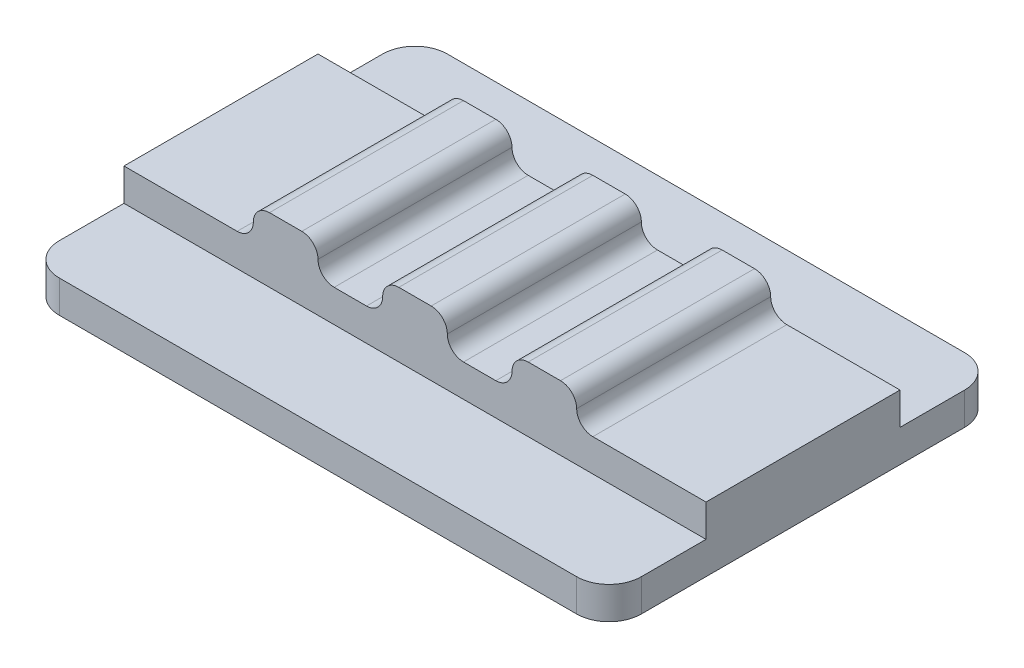
ISO-10303-21;
HEADER;
FILE_DESCRIPTION(('STEP AP214'),'2;1');
FILE_NAME('part.step','',(''),(''),'','','');
FILE_SCHEMA(('AUTOMOTIVE_DESIGN { 1 0 10303 214 1 1 1 1 }'));
ENDSEC;
DATA;
#1=APPLICATION_CONTEXT('core data for automotive mechanical design processes');
#2=APPLICATION_PROTOCOL_DEFINITION('international standard','automotive_design',2000,#1);
#3=PRODUCT_CONTEXT('',#1,'mechanical');
#4=PRODUCT('Part','Part','',(#3));
#5=PRODUCT_RELATED_PRODUCT_CATEGORY('part','',(#4));
#6=PRODUCT_DEFINITION_FORMATION('','',#4);
#7=PRODUCT_DEFINITION_CONTEXT('part definition',#1,'design');
#8=PRODUCT_DEFINITION('design','',#6,#7);
#9=PRODUCT_DEFINITION_SHAPE('','',#8);
#10=(LENGTH_UNIT() NAMED_UNIT(*) SI_UNIT(.MILLI.,.METRE.));
#11=(NAMED_UNIT(*) PLANE_ANGLE_UNIT() SI_UNIT($,.RADIAN.));
#12=(NAMED_UNIT(*) SI_UNIT($,.STERADIAN.) SOLID_ANGLE_UNIT());
#13=UNCERTAINTY_MEASURE_WITH_UNIT(LENGTH_MEASURE(1.E-05),#10,'distance_accuracy_value','');
#14=(GEOMETRIC_REPRESENTATION_CONTEXT(3) GLOBAL_UNCERTAINTY_ASSIGNED_CONTEXT((#13)) GLOBAL_UNIT_ASSIGNED_CONTEXT((#10,
#11,#12)) REPRESENTATION_CONTEXT('',''));
#15=CARTESIAN_POINT('',(0.,0.,0.));
#16=DIRECTION('',(0.,0.,1.));
#17=DIRECTION('',(1.,0.,0.));
#18=AXIS2_PLACEMENT_3D('',#15,#16,#17);
#19=CARTESIAN_POINT('',(0.,2.,0.));
#20=DIRECTION('',(0.,-1.,0.));
#21=DIRECTION('',(0.,0.,-1.));
#22=AXIS2_PLACEMENT_3D('',#19,#20,#21);
#23=PLANE('',#22);
#24=DIRECTION('',(-1.,0.,0.));
#25=VECTOR('',#24,1.);
#26=CARTESIAN_POINT('',(-9.,2.,-3.));
#27=LINE('',#26,#25);
#28=CARTESIAN_POINT('',(9.,2.,-3.));
#29=VERTEX_POINT('',#28);
#30=CARTESIAN_POINT('',(5.5,2.,-3.));
#31=VERTEX_POINT('',#30);
#32=EDGE_CURVE('E229',#29,#31,#27,.T.);
#33=ORIENTED_EDGE('',*,*,#32,.T.);
#34=DIRECTION('',(0.,0.,-1.));
#35=VECTOR('',#34,1.);
#36=CARTESIAN_POINT('',(5.5,2.,3.));
#37=LINE('',#36,#35);
#38=CARTESIAN_POINT('',(5.5,2.,3.));
#39=VERTEX_POINT('',#38);
#40=EDGE_CURVE('E346',#31,#39,#37,.F.);
#41=ORIENTED_EDGE('',*,*,#40,.T.);
#42=DIRECTION('',(1.,0.,0.));
#43=VECTOR('',#42,1.);
#44=CARTESIAN_POINT('',(-9.,2.,3.));
#45=LINE('',#44,#43);
#46=CARTESIAN_POINT('',(9.,2.,3.));
#47=VERTEX_POINT('',#46);
#48=EDGE_CURVE('E247',#39,#47,#45,.T.);
#49=ORIENTED_EDGE('',*,*,#48,.T.);
#50=DIRECTION('',(0.,0.,-1.));
#51=VECTOR('',#50,1.);
#52=CARTESIAN_POINT('',(9.,2.,3.));
#53=LINE('',#52,#51);
#54=EDGE_CURVE('E245',#47,#29,#53,.T.);
#55=ORIENTED_EDGE('',*,*,#54,.T.);
#56=EDGE_LOOP('',(#33,#41,#49,#55));
#57=FACE_BOUND('',#56,.T.);
#58=ADVANCED_FACE('F33',(#57),#23,.F.);
#59=CARTESIAN_POINT('',(1.5,2.,3.));
#60=VERTEX_POINT('',#59);
#61=CARTESIAN_POINT('',(2.5,2.,3.));
#62=VERTEX_POINT('',#61);
#63=EDGE_CURVE('E382',#60,#62,#45,.T.);
#64=ORIENTED_EDGE('',*,*,#63,.T.);
#65=DIRECTION('',(0.,0.,1.));
#66=VECTOR('',#65,1.);
#67=CARTESIAN_POINT('',(2.5,2.,-3.));
#68=LINE('',#67,#66);
#69=CARTESIAN_POINT('',(2.5,2.,-3.));
#70=VERTEX_POINT('',#69);
#71=EDGE_CURVE('E528',#62,#70,#68,.F.);
#72=ORIENTED_EDGE('',*,*,#71,.T.);
#73=CARTESIAN_POINT('',(1.5,2.,-3.));
#74=VERTEX_POINT('',#73);
#75=EDGE_CURVE('E242',#70,#74,#27,.T.);
#76=ORIENTED_EDGE('',*,*,#75,.T.);
#77=DIRECTION('',(0.,0.,-1.));
#78=VECTOR('',#77,1.);
#79=CARTESIAN_POINT('',(1.5,2.,3.));
#80=LINE('',#79,#78);
#81=EDGE_CURVE('E525',#74,#60,#80,.F.);
#82=ORIENTED_EDGE('',*,*,#81,.T.);
#83=EDGE_LOOP('',(#64,#72,#76,#82));
#84=FACE_BOUND('',#83,.T.);
#85=ADVANCED_FACE('F488',(#84),#23,.F.);
#86=CARTESIAN_POINT('',(-2.5,2.,3.));
#87=VERTEX_POINT('',#86);
#88=CARTESIAN_POINT('',(-1.5,2.,3.));
#89=VERTEX_POINT('',#88);
#90=EDGE_CURVE('E374',#87,#89,#45,.T.);
#91=ORIENTED_EDGE('',*,*,#90,.T.);
#92=DIRECTION('',(0.,0.,1.));
#93=VECTOR('',#92,1.);
#94=CARTESIAN_POINT('',(-1.5,2.,-3.));
#95=LINE('',#94,#93);
#96=CARTESIAN_POINT('',(-1.5,2.,-3.));
#97=VERTEX_POINT('',#96);
#98=EDGE_CURVE('E416',#89,#97,#95,.F.);
#99=ORIENTED_EDGE('',*,*,#98,.T.);
#100=CARTESIAN_POINT('',(-2.5,2.,-3.));
#101=VERTEX_POINT('',#100);
#102=EDGE_CURVE('E361',#97,#101,#27,.T.);
#103=ORIENTED_EDGE('',*,*,#102,.T.);
#104=DIRECTION('',(0.,0.,-1.));
#105=VECTOR('',#104,1.);
#106=CARTESIAN_POINT('',(-2.5,2.,3.));
#107=LINE('',#106,#105);
#108=EDGE_CURVE('E420',#101,#87,#107,.F.);
#109=ORIENTED_EDGE('',*,*,#108,.T.);
#110=EDGE_LOOP('',(#91,#99,#103,#109));
#111=FACE_BOUND('',#110,.T.);
#112=ADVANCED_FACE('F492',(#111),#23,.F.);
#113=CARTESIAN_POINT('',(-9.,2.,3.));
#114=VERTEX_POINT('',#113);
#115=CARTESIAN_POINT('',(-5.5,2.,3.));
#116=VERTEX_POINT('',#115);
#117=EDGE_CURVE('E373',#114,#116,#45,.T.);
#118=ORIENTED_EDGE('',*,*,#117,.T.);
#119=DIRECTION('',(0.,0.,1.));
#120=VECTOR('',#119,1.);
#121=CARTESIAN_POINT('',(-5.5,2.,-3.));
#122=LINE('',#121,#120);
#123=CARTESIAN_POINT('',(-5.5,2.,-3.));
#124=VERTEX_POINT('',#123);
#125=EDGE_CURVE('E418',#116,#124,#122,.F.);
#126=ORIENTED_EDGE('',*,*,#125,.T.);
#127=CARTESIAN_POINT('',(-9.,2.,-3.));
#128=VERTEX_POINT('',#127);
#129=EDGE_CURVE('E251',#124,#128,#27,.T.);
#130=ORIENTED_EDGE('',*,*,#129,.T.);
#131=DIRECTION('',(0.,0.,1.));
#132=VECTOR('',#131,1.);
#133=CARTESIAN_POINT('',(-9.,2.,3.));
#134=LINE('',#133,#132);
#135=EDGE_CURVE('E241',#128,#114,#134,.T.);
#136=ORIENTED_EDGE('',*,*,#135,.T.);
#137=EDGE_LOOP('',(#118,#126,#130,#136));
#138=FACE_BOUND('',#137,.T.);
#139=ADVANCED_FACE('F465',(#138),#23,.F.);
#140=CARTESIAN_POINT('',(0.,1.,0.));
#141=DIRECTION('',(0.,1.,0.));
#142=DIRECTION('',(0.,0.,1.));
#143=AXIS2_PLACEMENT_3D('',#140,#141,#142);
#144=PLANE('',#143);
#145=DIRECTION('',(1.,0.,0.));
#146=VECTOR('',#145,1.);
#147=CARTESIAN_POINT('',(-9.,1.,3.));
#148=LINE('',#147,#146);
#149=CARTESIAN_POINT('',(-9.,1.,3.));
#150=VERTEX_POINT('',#149);
#151=CARTESIAN_POINT('',(9.,1.,3.));
#152=VERTEX_POINT('',#151);
#153=EDGE_CURVE('E252',#150,#152,#148,.T.);
#154=ORIENTED_EDGE('',*,*,#153,.F.);
#155=DIRECTION('',(0.,0.,1.));
#156=VECTOR('',#155,1.);
#157=CARTESIAN_POINT('',(-9.,1.,-6.));
#158=LINE('',#157,#156);
#159=CARTESIAN_POINT('',(-9.,1.,5.));
#160=VERTEX_POINT('',#159);
#161=EDGE_CURVE('E293',#150,#160,#158,.T.);
#162=ORIENTED_EDGE('',*,*,#161,.T.);
#163=CARTESIAN_POINT('',(-8.,1.,5.));
#164=DIRECTION('',(0.,1.,0.));
#165=DIRECTION('',(0.,0.,1.));
#166=AXIS2_PLACEMENT_3D('',#163,#164,#165);
#167=CIRCLE('',#166,1.);
#168=CARTESIAN_POINT('',(-8.,1.,6.));
#169=VERTEX_POINT('',#168);
#170=EDGE_CURVE('E334',#160,#169,#167,.T.);
#171=ORIENTED_EDGE('',*,*,#170,.T.);
#172=DIRECTION('',(1.,0.,0.));
#173=VECTOR('',#172,1.);
#174=CARTESIAN_POINT('',(-9.,1.,6.));
#175=LINE('',#174,#173);
#176=CARTESIAN_POINT('',(8.,1.,6.));
#177=VERTEX_POINT('',#176);
#178=EDGE_CURVE('E299',#169,#177,#175,.T.);
#179=ORIENTED_EDGE('',*,*,#178,.T.);
#180=CARTESIAN_POINT('',(8.,1.,5.));
#181=DIRECTION('',(0.,1.,0.));
#182=DIRECTION('',(0.,0.,1.));
#183=AXIS2_PLACEMENT_3D('',#180,#181,#182);
#184=CIRCLE('',#183,1.);
#185=CARTESIAN_POINT('',(9.,1.,5.));
#186=VERTEX_POINT('',#185);
#187=EDGE_CURVE('E330',#177,#186,#184,.T.);
#188=ORIENTED_EDGE('',*,*,#187,.T.);
#189=DIRECTION('',(0.,0.,-1.));
#190=VECTOR('',#189,1.);
#191=CARTESIAN_POINT('',(9.,1.,-6.));
#192=LINE('',#191,#190);
#193=EDGE_CURVE('E291',#186,#152,#192,.T.);
#194=ORIENTED_EDGE('',*,*,#193,.T.);
#195=EDGE_LOOP('',(#154,#162,#171,#179,#188,#194));
#196=FACE_BOUND('',#195,.T.);
#197=ADVANCED_FACE('F495',(#196),#144,.T.);
#198=CARTESIAN_POINT('',(9.,1.,-6.));
#199=DIRECTION('',(-1.,0.,0.));
#200=DIRECTION('',(0.,0.,1.));
#201=AXIS2_PLACEMENT_3D('',#198,#199,#200);
#202=PLANE('',#201);
#203=DIRECTION('',(0.,0.,-1.));
#204=VECTOR('',#203,1.);
#205=CARTESIAN_POINT('',(9.,0.,-6.));
#206=LINE('',#205,#204);
#207=CARTESIAN_POINT('',(9.,0.,5.));
#208=VERTEX_POINT('',#207);
#209=CARTESIAN_POINT('',(9.,0.,-5.));
#210=VERTEX_POINT('',#209);
#211=EDGE_CURVE('E259',#208,#210,#206,.T.);
#212=ORIENTED_EDGE('',*,*,#211,.T.);
#213=DIRECTION('',(0.,-1.,0.));
#214=VECTOR('',#213,1.);
#215=CARTESIAN_POINT('',(9.,1.,-5.));
#216=LINE('',#215,#214);
#217=CARTESIAN_POINT('',(9.,1.,-5.));
#218=VERTEX_POINT('',#217);
#219=EDGE_CURVE('E345',#210,#218,#216,.F.);
#220=ORIENTED_EDGE('',*,*,#219,.T.);
#221=CARTESIAN_POINT('',(9.,1.,-3.));
#222=VERTEX_POINT('',#221);
#223=EDGE_CURVE('E258',#222,#218,#192,.T.);
#224=ORIENTED_EDGE('',*,*,#223,.F.);
#225=DIRECTION('',(0.,-1.,0.));
#226=VECTOR('',#225,1.);
#227=CARTESIAN_POINT('',(9.,2.,-3.));
#228=LINE('',#227,#226);
#229=EDGE_CURVE('E235',#29,#222,#228,.T.);
#230=ORIENTED_EDGE('',*,*,#229,.F.);
#231=ORIENTED_EDGE('',*,*,#54,.F.);
#232=DIRECTION('',(0.,-1.,0.));
#233=VECTOR('',#232,1.);
#234=CARTESIAN_POINT('',(9.,2.,3.));
#235=LINE('',#234,#233);
#236=EDGE_CURVE('E276',#47,#152,#235,.T.);
#237=ORIENTED_EDGE('',*,*,#236,.T.);
#238=ORIENTED_EDGE('',*,*,#193,.F.);
#239=DIRECTION('',(0.,-1.,0.));
#240=VECTOR('',#239,1.);
#241=CARTESIAN_POINT('',(9.,1.,5.));
#242=LINE('',#241,#240);
#243=EDGE_CURVE('E343',#186,#208,#242,.T.);
#244=ORIENTED_EDGE('',*,*,#243,.T.);
#245=EDGE_LOOP('',(#212,#220,#224,#230,#231,#237,#238,#244));
#246=FACE_BOUND('',#245,.T.);
#247=ADVANCED_FACE('F256',(#246),#202,.F.);
#248=CARTESIAN_POINT('',(-9.,1.,-6.));
#249=DIRECTION('',(0.,0.,1.));
#250=DIRECTION('',(1.,0.,0.));
#251=AXIS2_PLACEMENT_3D('',#248,#249,#250);
#252=PLANE('',#251);
#253=DIRECTION('',(-1.,0.,0.));
#254=VECTOR('',#253,1.);
#255=CARTESIAN_POINT('',(-9.,0.,-6.));
#256=LINE('',#255,#254);
#257=CARTESIAN_POINT('',(8.,0.,-6.));
#258=VERTEX_POINT('',#257);
#259=CARTESIAN_POINT('',(-8.,0.,-6.));
#260=VERTEX_POINT('',#259);
#261=EDGE_CURVE('E262',#258,#260,#256,.T.);
#262=ORIENTED_EDGE('',*,*,#261,.T.);
#263=DIRECTION('',(0.,-1.,0.));
#264=VECTOR('',#263,1.);
#265=CARTESIAN_POINT('',(-8.,1.,-6.));
#266=LINE('',#265,#264);
#267=CARTESIAN_POINT('',(-8.,1.,-6.));
#268=VERTEX_POINT('',#267);
#269=EDGE_CURVE('E328',#260,#268,#266,.F.);
#270=ORIENTED_EDGE('',*,*,#269,.T.);
#271=DIRECTION('',(-1.,0.,0.));
#272=VECTOR('',#271,1.);
#273=CARTESIAN_POINT('',(-9.,1.,-6.));
#274=LINE('',#273,#272);
#275=CARTESIAN_POINT('',(8.,1.,-6.));
#276=VERTEX_POINT('',#275);
#277=EDGE_CURVE('E285',#276,#268,#274,.T.);
#278=ORIENTED_EDGE('',*,*,#277,.F.);
#279=DIRECTION('',(0.,-1.,0.));
#280=VECTOR('',#279,1.);
#281=CARTESIAN_POINT('',(8.,1.,-6.));
#282=LINE('',#281,#280);
#283=EDGE_CURVE('E325',#276,#258,#282,.T.);
#284=ORIENTED_EDGE('',*,*,#283,.T.);
#285=EDGE_LOOP('',(#262,#270,#278,#284));
#286=FACE_BOUND('',#285,.T.);
#287=ADVANCED_FACE('F746',(#286),#252,.F.);
#288=CARTESIAN_POINT('',(-9.,1.,-6.));
#289=DIRECTION('',(1.,0.,0.));
#290=DIRECTION('',(0.,0.,-1.));
#291=AXIS2_PLACEMENT_3D('',#288,#289,#290);
#292=PLANE('',#291);
#293=CARTESIAN_POINT('',(-9.,1.,-5.));
#294=VERTEX_POINT('',#293);
#295=CARTESIAN_POINT('',(-9.,1.,-3.));
#296=VERTEX_POINT('',#295);
#297=EDGE_CURVE('E295',#294,#296,#158,.T.);
#298=ORIENTED_EDGE('',*,*,#297,.F.);
#299=DIRECTION('',(0.,-1.,0.));
#300=VECTOR('',#299,1.);
#301=CARTESIAN_POINT('',(-9.,1.,-5.));
#302=LINE('',#301,#300);
#303=CARTESIAN_POINT('',(-9.,0.,-5.));
#304=VERTEX_POINT('',#303);
#305=EDGE_CURVE('E314',#294,#304,#302,.T.);
#306=ORIENTED_EDGE('',*,*,#305,.T.);
#307=DIRECTION('',(0.,0.,1.));
#308=VECTOR('',#307,1.);
#309=CARTESIAN_POINT('',(-9.,0.,-6.));
#310=LINE('',#309,#308);
#311=CARTESIAN_POINT('',(-9.,0.,5.));
#312=VERTEX_POINT('',#311);
#313=EDGE_CURVE('E306',#304,#312,#310,.T.);
#314=ORIENTED_EDGE('',*,*,#313,.T.);
#315=DIRECTION('',(0.,-1.,0.));
#316=VECTOR('',#315,1.);
#317=CARTESIAN_POINT('',(-9.,1.,5.));
#318=LINE('',#317,#316);
#319=EDGE_CURVE('E302',#312,#160,#318,.F.);
#320=ORIENTED_EDGE('',*,*,#319,.T.);
#321=ORIENTED_EDGE('',*,*,#161,.F.);
#322=DIRECTION('',(0.,-1.,0.));
#323=VECTOR('',#322,1.);
#324=CARTESIAN_POINT('',(-9.,2.,3.));
#325=LINE('',#324,#323);
#326=EDGE_CURVE('E265',#114,#150,#325,.T.);
#327=ORIENTED_EDGE('',*,*,#326,.F.);
#328=ORIENTED_EDGE('',*,*,#135,.F.);
#329=DIRECTION('',(0.,-1.,0.));
#330=VECTOR('',#329,1.);
#331=CARTESIAN_POINT('',(-9.,2.,-3.));
#332=LINE('',#331,#330);
#333=EDGE_CURVE('E260',#128,#296,#332,.T.);
#334=ORIENTED_EDGE('',*,*,#333,.T.);
#335=EDGE_LOOP('',(#298,#306,#314,#320,#321,#327,#328,#334));
#336=FACE_BOUND('',#335,.T.);
#337=ADVANCED_FACE('F471',(#336),#292,.F.);
#338=CARTESIAN_POINT('',(-9.,1.,6.));
#339=DIRECTION('',(0.,0.,-1.));
#340=DIRECTION('',(-1.,0.,0.));
#341=AXIS2_PLACEMENT_3D('',#338,#339,#340);
#342=PLANE('',#341);
#343=ORIENTED_EDGE('',*,*,#178,.F.);
#344=DIRECTION('',(0.,-1.,0.));
#345=VECTOR('',#344,1.);
#346=CARTESIAN_POINT('',(-8.,1.,6.));
#347=LINE('',#346,#345);
#348=CARTESIAN_POINT('',(-8.,0.,6.));
#349=VERTEX_POINT('',#348);
#350=EDGE_CURVE('E340',#169,#349,#347,.T.);
#351=ORIENTED_EDGE('',*,*,#350,.T.);
#352=DIRECTION('',(1.,0.,0.));
#353=VECTOR('',#352,1.);
#354=CARTESIAN_POINT('',(-9.,0.,6.));
#355=LINE('',#354,#353);
#356=CARTESIAN_POINT('',(8.,0.,6.));
#357=VERTEX_POINT('',#356);
#358=EDGE_CURVE('E309',#349,#357,#355,.T.);
#359=ORIENTED_EDGE('',*,*,#358,.T.);
#360=DIRECTION('',(0.,-1.,0.));
#361=VECTOR('',#360,1.);
#362=CARTESIAN_POINT('',(8.,1.,6.));
#363=LINE('',#362,#361);
#364=EDGE_CURVE('E338',#357,#177,#363,.F.);
#365=ORIENTED_EDGE('',*,*,#364,.T.);
#366=EDGE_LOOP('',(#343,#351,#359,#365));
#367=FACE_BOUND('',#366,.T.);
#368=ADVANCED_FACE('F733',(#367),#342,.F.);
#369=DIRECTION('',(-1.,0.,0.));
#370=VECTOR('',#369,1.);
#371=CARTESIAN_POINT('',(-9.,1.,-3.));
#372=LINE('',#371,#370);
#373=EDGE_CURVE('E275',#222,#296,#372,.T.);
#374=ORIENTED_EDGE('',*,*,#373,.F.);
#375=ORIENTED_EDGE('',*,*,#223,.T.);
#376=CARTESIAN_POINT('',(8.,1.,-5.));
#377=DIRECTION('',(0.,1.,0.));
#378=DIRECTION('',(0.,0.,1.));
#379=AXIS2_PLACEMENT_3D('',#376,#377,#378);
#380=CIRCLE('',#379,1.);
#381=EDGE_CURVE('E332',#218,#276,#380,.T.);
#382=ORIENTED_EDGE('',*,*,#381,.T.);
#383=ORIENTED_EDGE('',*,*,#277,.T.);
#384=CARTESIAN_POINT('',(-8.,1.,-5.));
#385=DIRECTION('',(0.,1.,0.));
#386=DIRECTION('',(0.,0.,1.));
#387=AXIS2_PLACEMENT_3D('',#384,#385,#386);
#388=CIRCLE('',#387,1.);
#389=EDGE_CURVE('E336',#268,#294,#388,.T.);
#390=ORIENTED_EDGE('',*,*,#389,.T.);
#391=ORIENTED_EDGE('',*,*,#297,.T.);
#392=EDGE_LOOP('',(#374,#375,#382,#383,#390,#391));
#393=FACE_BOUND('',#392,.T.);
#394=ADVANCED_FACE('F502',(#393),#144,.T.);
#395=CARTESIAN_POINT('',(0.,0.,0.));
#396=DIRECTION('',(0.,1.,0.));
#397=DIRECTION('',(0.,0.,1.));
#398=AXIS2_PLACEMENT_3D('',#395,#396,#397);
#399=PLANE('',#398);
#400=ORIENTED_EDGE('',*,*,#313,.F.);
#401=CARTESIAN_POINT('',(-8.,0.,-5.));
#402=DIRECTION('',(0.,1.,0.));
#403=DIRECTION('',(0.,0.,1.));
#404=AXIS2_PLACEMENT_3D('',#401,#402,#403);
#405=CIRCLE('',#404,1.);
#406=EDGE_CURVE('E323',#304,#260,#405,.F.);
#407=ORIENTED_EDGE('',*,*,#406,.T.);
#408=ORIENTED_EDGE('',*,*,#261,.F.);
#409=CARTESIAN_POINT('',(8.,0.,-5.));
#410=DIRECTION('',(0.,1.,0.));
#411=DIRECTION('',(0.,0.,1.));
#412=AXIS2_PLACEMENT_3D('',#409,#410,#411);
#413=CIRCLE('',#412,1.);
#414=EDGE_CURVE('E319',#258,#210,#413,.F.);
#415=ORIENTED_EDGE('',*,*,#414,.T.);
#416=ORIENTED_EDGE('',*,*,#211,.F.);
#417=CARTESIAN_POINT('',(8.,0.,5.));
#418=DIRECTION('',(0.,1.,0.));
#419=DIRECTION('',(0.,0.,1.));
#420=AXIS2_PLACEMENT_3D('',#417,#418,#419);
#421=CIRCLE('',#420,1.);
#422=EDGE_CURVE('E317',#208,#357,#421,.F.);
#423=ORIENTED_EDGE('',*,*,#422,.T.);
#424=ORIENTED_EDGE('',*,*,#358,.F.);
#425=CARTESIAN_POINT('',(-8.,0.,5.));
#426=DIRECTION('',(0.,1.,0.));
#427=DIRECTION('',(0.,0.,1.));
#428=AXIS2_PLACEMENT_3D('',#425,#426,#427);
#429=CIRCLE('',#428,1.);
#430=EDGE_CURVE('E321',#349,#312,#429,.F.);
#431=ORIENTED_EDGE('',*,*,#430,.T.);
#432=EDGE_LOOP('',(#400,#407,#408,#415,#416,#423,#424,#431));
#433=FACE_BOUND('',#432,.T.);
#434=ADVANCED_FACE('F732',(#433),#399,.F.);
#435=CARTESIAN_POINT('',(-8.,1.,-5.));
#436=DIRECTION('',(0.,-1.,0.));
#437=DIRECTION('',(0.,0.,-1.));
#438=AXIS2_PLACEMENT_3D('',#435,#436,#437);
#439=CYLINDRICAL_SURFACE('',#438,1.);
#440=ORIENTED_EDGE('',*,*,#389,.F.);
#441=ORIENTED_EDGE('',*,*,#269,.F.);
#442=ORIENTED_EDGE('',*,*,#406,.F.);
#443=ORIENTED_EDGE('',*,*,#305,.F.);
#444=EDGE_LOOP('',(#440,#441,#442,#443));
#445=FACE_BOUND('',#444,.T.);
#446=ADVANCED_FACE('F792',(#445),#439,.T.);
#447=CARTESIAN_POINT('',(-8.,1.,5.));
#448=DIRECTION('',(0.,-1.,0.));
#449=DIRECTION('',(0.,0.,-1.));
#450=AXIS2_PLACEMENT_3D('',#447,#448,#449);
#451=CYLINDRICAL_SURFACE('',#450,1.);
#452=ORIENTED_EDGE('',*,*,#170,.F.);
#453=ORIENTED_EDGE('',*,*,#319,.F.);
#454=ORIENTED_EDGE('',*,*,#430,.F.);
#455=ORIENTED_EDGE('',*,*,#350,.F.);
#456=EDGE_LOOP('',(#452,#453,#454,#455));
#457=FACE_BOUND('',#456,.T.);
#458=ADVANCED_FACE('F782',(#457),#451,.T.);
#459=CARTESIAN_POINT('',(8.,1.,-5.));
#460=DIRECTION('',(0.,-1.,0.));
#461=DIRECTION('',(0.,0.,-1.));
#462=AXIS2_PLACEMENT_3D('',#459,#460,#461);
#463=CYLINDRICAL_SURFACE('',#462,1.);
#464=ORIENTED_EDGE('',*,*,#381,.F.);
#465=ORIENTED_EDGE('',*,*,#219,.F.);
#466=ORIENTED_EDGE('',*,*,#414,.F.);
#467=ORIENTED_EDGE('',*,*,#283,.F.);
#468=EDGE_LOOP('',(#464,#465,#466,#467));
#469=FACE_BOUND('',#468,.T.);
#470=ADVANCED_FACE('F772',(#469),#463,.T.);
#471=CARTESIAN_POINT('',(8.,1.,5.));
#472=DIRECTION('',(0.,-1.,0.));
#473=DIRECTION('',(0.,0.,-1.));
#474=AXIS2_PLACEMENT_3D('',#471,#472,#473);
#475=CYLINDRICAL_SURFACE('',#474,1.);
#476=ORIENTED_EDGE('',*,*,#187,.F.);
#477=ORIENTED_EDGE('',*,*,#364,.F.);
#478=ORIENTED_EDGE('',*,*,#422,.F.);
#479=ORIENTED_EDGE('',*,*,#243,.F.);
#480=EDGE_LOOP('',(#476,#477,#478,#479));
#481=FACE_BOUND('',#480,.T.);
#482=ADVANCED_FACE('F484',(#481),#475,.T.);
#483=CARTESIAN_POINT('',(-9.,2.,-3.));
#484=DIRECTION('',(0.,0.,1.));
#485=DIRECTION('',(1.,0.,0.));
#486=AXIS2_PLACEMENT_3D('',#483,#484,#485);
#487=PLANE('',#486);
#488=DIRECTION('',(-1.,0.,0.));
#489=VECTOR('',#488,1.);
#490=CARTESIAN_POINT('',(3.,3.,-3.));
#491=LINE('',#490,#489);
#492=CARTESIAN_POINT('',(4.5,3.,-3.));
#493=VERTEX_POINT('',#492);
#494=CARTESIAN_POINT('',(3.5,3.,-3.));
#495=VERTEX_POINT('',#494);
#496=EDGE_CURVE('E448',#493,#495,#491,.T.);
#497=ORIENTED_EDGE('',*,*,#496,.F.);
#498=CARTESIAN_POINT('',(4.5,2.5,-3.));
#499=DIRECTION('',(0.,0.,1.));
#500=DIRECTION('',(1.,0.,0.));
#501=AXIS2_PLACEMENT_3D('',#498,#499,#500);
#502=CIRCLE('',#501,0.5);
#503=CARTESIAN_POINT('',(5.,2.5,-3.));
#504=VERTEX_POINT('',#503);
#505=EDGE_CURVE('E385',#493,#504,#502,.F.);
#506=ORIENTED_EDGE('',*,*,#505,.T.);
#507=CARTESIAN_POINT('',(5.5,2.5,-3.));
#508=DIRECTION('',(0.,0.,1.));
#509=DIRECTION('',(1.,0.,0.));
#510=AXIS2_PLACEMENT_3D('',#507,#508,#509);
#511=CIRCLE('',#510,0.5);
#512=EDGE_CURVE('E237',#504,#31,#511,.T.);
#513=ORIENTED_EDGE('',*,*,#512,.T.);
#514=ORIENTED_EDGE('',*,*,#32,.F.);
#515=ORIENTED_EDGE('',*,*,#229,.T.);
#516=ORIENTED_EDGE('',*,*,#373,.T.);
#517=ORIENTED_EDGE('',*,*,#333,.F.);
#518=ORIENTED_EDGE('',*,*,#129,.F.);
#519=CARTESIAN_POINT('',(-5.5,2.5,-3.));
#520=DIRECTION('',(0.,0.,1.));
#521=DIRECTION('',(1.,0.,0.));
#522=AXIS2_PLACEMENT_3D('',#519,#520,#521);
#523=CIRCLE('',#522,0.5);
#524=CARTESIAN_POINT('',(-5.,2.5,-3.));
#525=VERTEX_POINT('',#524);
#526=EDGE_CURVE('E11',#124,#525,#523,.T.);
#527=ORIENTED_EDGE('',*,*,#526,.T.);
#528=CARTESIAN_POINT('',(-4.5,2.5,-3.));
#529=DIRECTION('',(0.,0.,1.));
#530=DIRECTION('',(1.,0.,0.));
#531=AXIS2_PLACEMENT_3D('',#528,#529,#530);
#532=CIRCLE('',#531,0.5);
#533=CARTESIAN_POINT('',(-4.5,3.,-3.));
#534=VERTEX_POINT('',#533);
#535=EDGE_CURVE('E358',#525,#534,#532,.F.);
#536=ORIENTED_EDGE('',*,*,#535,.T.);
#537=DIRECTION('',(-1.,0.,0.));
#538=VECTOR('',#537,1.);
#539=CARTESIAN_POINT('',(-5.,3.,-3.));
#540=LINE('',#539,#538);
#541=CARTESIAN_POINT('',(-3.5,3.,-3.));
#542=VERTEX_POINT('',#541);
#543=EDGE_CURVE('E397',#542,#534,#540,.T.);
#544=ORIENTED_EDGE('',*,*,#543,.F.);
#545=CARTESIAN_POINT('',(-3.5,2.5,-3.));
#546=DIRECTION('',(0.,0.,1.));
#547=DIRECTION('',(1.,0.,0.));
#548=AXIS2_PLACEMENT_3D('',#545,#546,#547);
#549=CIRCLE('',#548,0.5);
#550=CARTESIAN_POINT('',(-3.,2.5,-3.));
#551=VERTEX_POINT('',#550);
#552=EDGE_CURVE('E393',#542,#551,#549,.F.);
#553=ORIENTED_EDGE('',*,*,#552,.T.);
#554=CARTESIAN_POINT('',(-2.5,2.5,-3.));
#555=DIRECTION('',(0.,0.,1.));
#556=DIRECTION('',(1.,0.,0.));
#557=AXIS2_PLACEMENT_3D('',#554,#555,#556);
#558=CIRCLE('',#557,0.5);
#559=EDGE_CURVE('E440',#551,#101,#558,.T.);
#560=ORIENTED_EDGE('',*,*,#559,.T.);
#561=ORIENTED_EDGE('',*,*,#102,.F.);
#562=CARTESIAN_POINT('',(-1.5,2.5,-3.));
#563=DIRECTION('',(0.,0.,1.));
#564=DIRECTION('',(1.,0.,0.));
#565=AXIS2_PLACEMENT_3D('',#562,#563,#564);
#566=CIRCLE('',#565,0.5);
#567=CARTESIAN_POINT('',(-1.,2.5,-3.));
#568=VERTEX_POINT('',#567);
#569=EDGE_CURVE('E438',#97,#568,#566,.T.);
#570=ORIENTED_EDGE('',*,*,#569,.T.);
#571=CARTESIAN_POINT('',(-0.5,2.5,-3.));
#572=DIRECTION('',(0.,0.,1.));
#573=DIRECTION('',(1.,0.,0.));
#574=AXIS2_PLACEMENT_3D('',#571,#572,#573);
#575=CIRCLE('',#574,0.5);
#576=CARTESIAN_POINT('',(-0.5,3.,-3.));
#577=VERTEX_POINT('',#576);
#578=EDGE_CURVE('E391',#568,#577,#575,.F.);
#579=ORIENTED_EDGE('',*,*,#578,.T.);
#580=DIRECTION('',(-1.,0.,0.));
#581=VECTOR('',#580,1.);
#582=CARTESIAN_POINT('',(-1.,3.,-3.));
#583=LINE('',#582,#581);
#584=CARTESIAN_POINT('',(0.5,3.,-3.));
#585=VERTEX_POINT('',#584);
#586=EDGE_CURVE('E546',#585,#577,#583,.T.);
#587=ORIENTED_EDGE('',*,*,#586,.F.);
#588=CARTESIAN_POINT('',(0.5,2.5,-3.));
#589=DIRECTION('',(0.,0.,1.));
#590=DIRECTION('',(1.,0.,0.));
#591=AXIS2_PLACEMENT_3D('',#588,#589,#590);
#592=CIRCLE('',#591,0.5);
#593=CARTESIAN_POINT('',(1.,2.5,-3.));
#594=VERTEX_POINT('',#593);
#595=EDGE_CURVE('E389',#585,#594,#592,.F.);
#596=ORIENTED_EDGE('',*,*,#595,.T.);
#597=CARTESIAN_POINT('',(1.5,2.5,-3.));
#598=DIRECTION('',(0.,0.,1.));
#599=DIRECTION('',(1.,0.,0.));
#600=AXIS2_PLACEMENT_3D('',#597,#598,#599);
#601=CIRCLE('',#600,0.5);
#602=EDGE_CURVE('E432',#594,#74,#601,.T.);
#603=ORIENTED_EDGE('',*,*,#602,.T.);
#604=ORIENTED_EDGE('',*,*,#75,.F.);
#605=CARTESIAN_POINT('',(2.5,2.5,-3.));
#606=DIRECTION('',(0.,0.,1.));
#607=DIRECTION('',(1.,0.,0.));
#608=AXIS2_PLACEMENT_3D('',#605,#606,#607);
#609=CIRCLE('',#608,0.5);
#610=CARTESIAN_POINT('',(3.,2.5,-3.));
#611=VERTEX_POINT('',#610);
#612=EDGE_CURVE('E430',#70,#611,#609,.T.);
#613=ORIENTED_EDGE('',*,*,#612,.T.);
#614=CARTESIAN_POINT('',(3.5,2.5,-3.));
#615=DIRECTION('',(0.,0.,1.));
#616=DIRECTION('',(1.,0.,0.));
#617=AXIS2_PLACEMENT_3D('',#614,#615,#616);
#618=CIRCLE('',#617,0.5);
#619=EDGE_CURVE('E387',#611,#495,#618,.F.);
#620=ORIENTED_EDGE('',*,*,#619,.T.);
#621=EDGE_LOOP('',(#497,#506,#513,#514,#515,#516,#517,#518,#527,#536,#544,#553,#560,#561,#570,
#579,#587,#596,#603,#604,#613,#620));
#622=FACE_BOUND('',#621,.T.);
#623=ADVANCED_FACE('F232',(#622),#487,.F.);
#624=CARTESIAN_POINT('',(-9.,2.,3.));
#625=DIRECTION('',(0.,0.,-1.));
#626=DIRECTION('',(-1.,0.,0.));
#627=AXIS2_PLACEMENT_3D('',#624,#625,#626);
#628=PLANE('',#627);
#629=ORIENTED_EDGE('',*,*,#48,.F.);
#630=CARTESIAN_POINT('',(5.5,2.5,3.));
#631=DIRECTION('',(0.,0.,-1.));
#632=DIRECTION('',(-1.,0.,0.));
#633=AXIS2_PLACEMENT_3D('',#630,#631,#632);
#634=CIRCLE('',#633,0.5);
#635=CARTESIAN_POINT('',(5.,2.5,3.));
#636=VERTEX_POINT('',#635);
#637=EDGE_CURVE('E426',#39,#636,#634,.T.);
#638=ORIENTED_EDGE('',*,*,#637,.T.);
#639=CARTESIAN_POINT('',(4.5,2.5,3.));
#640=DIRECTION('',(0.,0.,-1.));
#641=DIRECTION('',(-1.,0.,0.));
#642=AXIS2_PLACEMENT_3D('',#639,#640,#641);
#643=CIRCLE('',#642,0.5);
#644=CARTESIAN_POINT('',(4.5,3.,3.));
#645=VERTEX_POINT('',#644);
#646=EDGE_CURVE('E533',#636,#645,#643,.F.);
#647=ORIENTED_EDGE('',*,*,#646,.T.);
#648=DIRECTION('',(1.,0.,0.));
#649=VECTOR('',#648,1.);
#650=CARTESIAN_POINT('',(3.,3.,3.));
#651=LINE('',#650,#649);
#652=CARTESIAN_POINT('',(3.5,3.,3.));
#653=VERTEX_POINT('',#652);
#654=EDGE_CURVE('E413',#653,#645,#651,.T.);
#655=ORIENTED_EDGE('',*,*,#654,.F.);
#656=CARTESIAN_POINT('',(3.5,2.5,3.));
#657=DIRECTION('',(0.,0.,-1.));
#658=DIRECTION('',(-1.,0.,0.));
#659=AXIS2_PLACEMENT_3D('',#656,#657,#658);
#660=CIRCLE('',#659,0.5);
#661=CARTESIAN_POINT('',(3.,2.5,3.));
#662=VERTEX_POINT('',#661);
#663=EDGE_CURVE('E537',#653,#662,#660,.F.);
#664=ORIENTED_EDGE('',*,*,#663,.T.);
#665=CARTESIAN_POINT('',(2.5,2.5,3.));
#666=DIRECTION('',(0.,0.,-1.));
#667=DIRECTION('',(-1.,0.,0.));
#668=AXIS2_PLACEMENT_3D('',#665,#666,#667);
#669=CIRCLE('',#668,0.5);
#670=EDGE_CURVE('E428',#662,#62,#669,.T.);
#671=ORIENTED_EDGE('',*,*,#670,.T.);
#672=ORIENTED_EDGE('',*,*,#63,.F.);
#673=CARTESIAN_POINT('',(1.5,2.5,3.));
#674=DIRECTION('',(0.,0.,-1.));
#675=DIRECTION('',(-1.,0.,0.));
#676=AXIS2_PLACEMENT_3D('',#673,#674,#675);
#677=CIRCLE('',#676,0.5);
#678=CARTESIAN_POINT('',(1.,2.5,3.));
#679=VERTEX_POINT('',#678);
#680=EDGE_CURVE('E434',#60,#679,#677,.T.);
#681=ORIENTED_EDGE('',*,*,#680,.T.);
#682=CARTESIAN_POINT('',(0.5,2.5,3.));
#683=DIRECTION('',(0.,0.,-1.));
#684=DIRECTION('',(-1.,0.,0.));
#685=AXIS2_PLACEMENT_3D('',#682,#683,#684);
#686=CIRCLE('',#685,0.5);
#687=CARTESIAN_POINT('',(0.5,3.,3.));
#688=VERTEX_POINT('',#687);
#689=EDGE_CURVE('E556',#679,#688,#686,.F.);
#690=ORIENTED_EDGE('',*,*,#689,.T.);
#691=DIRECTION('',(1.,0.,0.));
#692=VECTOR('',#691,1.);
#693=CARTESIAN_POINT('',(-1.,3.,3.));
#694=LINE('',#693,#692);
#695=CARTESIAN_POINT('',(-0.5,3.,3.));
#696=VERTEX_POINT('',#695);
#697=EDGE_CURVE('E549',#696,#688,#694,.T.);
#698=ORIENTED_EDGE('',*,*,#697,.F.);
#699=CARTESIAN_POINT('',(-0.5,2.5,3.));
#700=DIRECTION('',(0.,0.,-1.));
#701=DIRECTION('',(-1.,0.,0.));
#702=AXIS2_PLACEMENT_3D('',#699,#700,#701);
#703=CIRCLE('',#702,0.5);
#704=CARTESIAN_POINT('',(-1.,2.5,3.));
#705=VERTEX_POINT('',#704);
#706=EDGE_CURVE('E557',#696,#705,#703,.F.);
#707=ORIENTED_EDGE('',*,*,#706,.T.);
#708=CARTESIAN_POINT('',(-1.5,2.5,3.));
#709=DIRECTION('',(0.,0.,-1.));
#710=DIRECTION('',(-1.,0.,0.));
#711=AXIS2_PLACEMENT_3D('',#708,#709,#710);
#712=CIRCLE('',#711,0.5);
#713=EDGE_CURVE('E436',#705,#89,#712,.T.);
#714=ORIENTED_EDGE('',*,*,#713,.T.);
#715=ORIENTED_EDGE('',*,*,#90,.F.);
#716=CARTESIAN_POINT('',(-2.5,2.5,3.));
#717=DIRECTION('',(0.,0.,-1.));
#718=DIRECTION('',(-1.,0.,0.));
#719=AXIS2_PLACEMENT_3D('',#716,#717,#718);
#720=CIRCLE('',#719,0.5);
#721=CARTESIAN_POINT('',(-3.,2.5,3.));
#722=VERTEX_POINT('',#721);
#723=EDGE_CURVE('E442',#87,#722,#720,.T.);
#724=ORIENTED_EDGE('',*,*,#723,.T.);
#725=CARTESIAN_POINT('',(-3.5,2.5,3.));
#726=DIRECTION('',(0.,0.,-1.));
#727=DIRECTION('',(-1.,0.,0.));
#728=AXIS2_PLACEMENT_3D('',#725,#726,#727);
#729=CIRCLE('',#728,0.5);
#730=CARTESIAN_POINT('',(-3.5,3.,3.));
#731=VERTEX_POINT('',#730);
#732=EDGE_CURVE('E559',#722,#731,#729,.F.);
#733=ORIENTED_EDGE('',*,*,#732,.T.);
#734=DIRECTION('',(1.,0.,0.));
#735=VECTOR('',#734,1.);
#736=CARTESIAN_POINT('',(-5.,3.,3.));
#737=LINE('',#736,#735);
#738=CARTESIAN_POINT('',(-4.5,3.,3.));
#739=VERTEX_POINT('',#738);
#740=EDGE_CURVE('E412',#739,#731,#737,.T.);
#741=ORIENTED_EDGE('',*,*,#740,.F.);
#742=CARTESIAN_POINT('',(-4.5,2.5,3.));
#743=DIRECTION('',(0.,0.,-1.));
#744=DIRECTION('',(-1.,0.,0.));
#745=AXIS2_PLACEMENT_3D('',#742,#743,#744);
#746=CIRCLE('',#745,0.5);
#747=CARTESIAN_POINT('',(-5.,2.5,3.));
#748=VERTEX_POINT('',#747);
#749=EDGE_CURVE('E54',#739,#748,#746,.F.);
#750=ORIENTED_EDGE('',*,*,#749,.T.);
#751=CARTESIAN_POINT('',(-5.5,2.5,3.));
#752=DIRECTION('',(0.,0.,-1.));
#753=DIRECTION('',(-1.,0.,0.));
#754=AXIS2_PLACEMENT_3D('',#751,#752,#753);
#755=CIRCLE('',#754,0.5);
#756=EDGE_CURVE('E42',#748,#116,#755,.T.);
#757=ORIENTED_EDGE('',*,*,#756,.T.);
#758=ORIENTED_EDGE('',*,*,#117,.F.);
#759=ORIENTED_EDGE('',*,*,#326,.T.);
#760=ORIENTED_EDGE('',*,*,#153,.T.);
#761=ORIENTED_EDGE('',*,*,#236,.F.);
#762=EDGE_LOOP('',(#629,#638,#647,#655,#664,#671,#672,#681,#690,#698,#707,#714,#715,#724,#733,
#741,#750,#757,#758,#759,#760,#761));
#763=FACE_BOUND('',#762,.T.);
#764=ADVANCED_FACE('F474',(#763),#628,.F.);
#765=CARTESIAN_POINT('',(0.,3.,0.));
#766=DIRECTION('',(0.,1.,0.));
#767=DIRECTION('',(0.,0.,1.));
#768=AXIS2_PLACEMENT_3D('',#765,#766,#767);
#769=PLANE('',#768);
#770=ORIENTED_EDGE('',*,*,#697,.T.);
#771=DIRECTION('',(0.,0.,-1.));
#772=VECTOR('',#771,1.);
#773=CARTESIAN_POINT('',(0.5,3.,-3.));
#774=LINE('',#773,#772);
#775=EDGE_CURVE('E543',#688,#585,#774,.T.);
#776=ORIENTED_EDGE('',*,*,#775,.T.);
#777=ORIENTED_EDGE('',*,*,#586,.T.);
#778=DIRECTION('',(0.,0.,1.));
#779=VECTOR('',#778,1.);
#780=CARTESIAN_POINT('',(-0.5,3.,3.));
#781=LINE('',#780,#779);
#782=EDGE_CURVE('E535',#577,#696,#781,.T.);
#783=ORIENTED_EDGE('',*,*,#782,.T.);
#784=EDGE_LOOP('',(#770,#776,#777,#783));
#785=FACE_BOUND('',#784,.T.);
#786=ADVANCED_FACE('F476',(#785),#769,.T.);
#787=CARTESIAN_POINT('',(0.,3.,0.));
#788=DIRECTION('',(0.,1.,0.));
#789=DIRECTION('',(0.,0.,1.));
#790=AXIS2_PLACEMENT_3D('',#787,#788,#789);
#791=PLANE('',#790);
#792=ORIENTED_EDGE('',*,*,#740,.T.);
#793=DIRECTION('',(0.,0.,-1.));
#794=VECTOR('',#793,1.);
#795=CARTESIAN_POINT('',(-3.5,3.,-3.));
#796=LINE('',#795,#794);
#797=EDGE_CURVE('E411',#731,#542,#796,.T.);
#798=ORIENTED_EDGE('',*,*,#797,.T.);
#799=ORIENTED_EDGE('',*,*,#543,.T.);
#800=DIRECTION('',(0.,0.,1.));
#801=VECTOR('',#800,1.);
#802=CARTESIAN_POINT('',(-4.5,3.,3.));
#803=LINE('',#802,#801);
#804=EDGE_CURVE('E409',#534,#739,#803,.T.);
#805=ORIENTED_EDGE('',*,*,#804,.T.);
#806=EDGE_LOOP('',(#792,#798,#799,#805));
#807=FACE_BOUND('',#806,.T.);
#808=ADVANCED_FACE('F408',(#807),#791,.T.);
#809=CARTESIAN_POINT('',(0.,3.,0.));
#810=DIRECTION('',(0.,1.,0.));
#811=DIRECTION('',(0.,0.,1.));
#812=AXIS2_PLACEMENT_3D('',#809,#810,#811);
#813=PLANE('',#812);
#814=ORIENTED_EDGE('',*,*,#654,.T.);
#815=DIRECTION('',(0.,0.,-1.));
#816=VECTOR('',#815,1.);
#817=CARTESIAN_POINT('',(4.5,3.,-3.));
#818=LINE('',#817,#816);
#819=EDGE_CURVE('E352',#645,#493,#818,.T.);
#820=ORIENTED_EDGE('',*,*,#819,.T.);
#821=ORIENTED_EDGE('',*,*,#496,.T.);
#822=DIRECTION('',(0.,0.,1.));
#823=VECTOR('',#822,1.);
#824=CARTESIAN_POINT('',(3.5,3.,3.));
#825=LINE('',#824,#823);
#826=EDGE_CURVE('E349',#495,#653,#825,.T.);
#827=ORIENTED_EDGE('',*,*,#826,.T.);
#828=EDGE_LOOP('',(#814,#820,#821,#827));
#829=FACE_BOUND('',#828,.T.);
#830=ADVANCED_FACE('F665',(#829),#813,.T.);
#831=CARTESIAN_POINT('',(4.5,2.5,0.));
#832=DIRECTION('',(0.,0.,1.));
#833=DIRECTION('',(1.,0.,0.));
#834=AXIS2_PLACEMENT_3D('',#831,#832,#833);
#835=CYLINDRICAL_SURFACE('',#834,0.5);
#836=ORIENTED_EDGE('',*,*,#819,.F.);
#837=ORIENTED_EDGE('',*,*,#646,.F.);
#838=DIRECTION('',(0.,0.,-1.));
#839=VECTOR('',#838,1.);
#840=CARTESIAN_POINT('',(5.,2.5,3.));
#841=LINE('',#840,#839);
#842=EDGE_CURVE('E445',#504,#636,#841,.F.);
#843=ORIENTED_EDGE('',*,*,#842,.F.);
#844=ORIENTED_EDGE('',*,*,#505,.F.);
#845=EDGE_LOOP('',(#836,#837,#843,#844));
#846=FACE_BOUND('',#845,.T.);
#847=ADVANCED_FACE('F655',(#846),#835,.T.);
#848=CARTESIAN_POINT('',(5.5,2.5,-3.));
#849=DIRECTION('',(0.,0.,1.));
#850=DIRECTION('',(1.,0.,0.));
#851=AXIS2_PLACEMENT_3D('',#848,#849,#850);
#852=CYLINDRICAL_SURFACE('',#851,0.5);
#853=ORIENTED_EDGE('',*,*,#637,.F.);
#854=ORIENTED_EDGE('',*,*,#40,.F.);
#855=ORIENTED_EDGE('',*,*,#512,.F.);
#856=ORIENTED_EDGE('',*,*,#842,.T.);
#857=EDGE_LOOP('',(#853,#854,#855,#856));
#858=FACE_BOUND('',#857,.T.);
#859=ADVANCED_FACE('F645',(#858),#852,.F.);
#860=CARTESIAN_POINT('',(2.5,2.5,-3.));
#861=DIRECTION('',(0.,0.,-1.));
#862=DIRECTION('',(-1.,0.,0.));
#863=AXIS2_PLACEMENT_3D('',#860,#861,#862);
#864=CYLINDRICAL_SURFACE('',#863,0.5);
#865=DIRECTION('',(0.,0.,1.));
#866=VECTOR('',#865,1.);
#867=CARTESIAN_POINT('',(3.,2.5,3.));
#868=LINE('',#867,#866);
#869=EDGE_CURVE('E449',#611,#662,#868,.T.);
#870=ORIENTED_EDGE('',*,*,#869,.F.);
#871=ORIENTED_EDGE('',*,*,#612,.F.);
#872=ORIENTED_EDGE('',*,*,#71,.F.);
#873=ORIENTED_EDGE('',*,*,#670,.F.);
#874=EDGE_LOOP('',(#870,#871,#872,#873));
#875=FACE_BOUND('',#874,.T.);
#876=ADVANCED_FACE('F635',(#875),#864,.F.);
#877=CARTESIAN_POINT('',(3.5,2.5,0.));
#878=DIRECTION('',(0.,0.,-1.));
#879=DIRECTION('',(-1.,0.,0.));
#880=AXIS2_PLACEMENT_3D('',#877,#878,#879);
#881=CYLINDRICAL_SURFACE('',#880,0.5);
#882=ORIENTED_EDGE('',*,*,#619,.F.);
#883=ORIENTED_EDGE('',*,*,#869,.T.);
#884=ORIENTED_EDGE('',*,*,#663,.F.);
#885=ORIENTED_EDGE('',*,*,#826,.F.);
#886=EDGE_LOOP('',(#882,#883,#884,#885));
#887=FACE_BOUND('',#886,.T.);
#888=ADVANCED_FACE('F626',(#887),#881,.T.);
#889=CARTESIAN_POINT('',(0.5,2.5,0.));
#890=DIRECTION('',(0.,0.,1.));
#891=DIRECTION('',(1.,0.,0.));
#892=AXIS2_PLACEMENT_3D('',#889,#890,#891);
#893=CYLINDRICAL_SURFACE('',#892,0.5);
#894=ORIENTED_EDGE('',*,*,#775,.F.);
#895=ORIENTED_EDGE('',*,*,#689,.F.);
#896=DIRECTION('',(0.,0.,-1.));
#897=VECTOR('',#896,1.);
#898=CARTESIAN_POINT('',(1.,2.5,3.));
#899=LINE('',#898,#897);
#900=EDGE_CURVE('E452',#594,#679,#899,.F.);
#901=ORIENTED_EDGE('',*,*,#900,.F.);
#902=ORIENTED_EDGE('',*,*,#595,.F.);
#903=EDGE_LOOP('',(#894,#895,#901,#902));
#904=FACE_BOUND('',#903,.T.);
#905=ADVANCED_FACE('F555',(#904),#893,.T.);
#906=CARTESIAN_POINT('',(1.5,2.5,-3.));
#907=DIRECTION('',(0.,0.,1.));
#908=DIRECTION('',(1.,0.,0.));
#909=AXIS2_PLACEMENT_3D('',#906,#907,#908);
#910=CYLINDRICAL_SURFACE('',#909,0.5);
#911=ORIENTED_EDGE('',*,*,#680,.F.);
#912=ORIENTED_EDGE('',*,*,#81,.F.);
#913=ORIENTED_EDGE('',*,*,#602,.F.);
#914=ORIENTED_EDGE('',*,*,#900,.T.);
#915=EDGE_LOOP('',(#911,#912,#913,#914));
#916=FACE_BOUND('',#915,.T.);
#917=ADVANCED_FACE('F532',(#916),#910,.F.);
#918=CARTESIAN_POINT('',(-1.5,2.5,-3.));
#919=DIRECTION('',(0.,0.,-1.));
#920=DIRECTION('',(-1.,0.,0.));
#921=AXIS2_PLACEMENT_3D('',#918,#919,#920);
#922=CYLINDRICAL_SURFACE('',#921,0.5);
#923=DIRECTION('',(0.,0.,1.));
#924=VECTOR('',#923,1.);
#925=CARTESIAN_POINT('',(-1.,2.5,3.));
#926=LINE('',#925,#924);
#927=EDGE_CURVE('E455',#568,#705,#926,.T.);
#928=ORIENTED_EDGE('',*,*,#927,.F.);
#929=ORIENTED_EDGE('',*,*,#569,.F.);
#930=ORIENTED_EDGE('',*,*,#98,.F.);
#931=ORIENTED_EDGE('',*,*,#713,.F.);
#932=EDGE_LOOP('',(#928,#929,#930,#931));
#933=FACE_BOUND('',#932,.T.);
#934=ADVANCED_FACE('F517',(#933),#922,.F.);
#935=CARTESIAN_POINT('',(-0.5,2.5,0.));
#936=DIRECTION('',(0.,0.,-1.));
#937=DIRECTION('',(-1.,0.,0.));
#938=AXIS2_PLACEMENT_3D('',#935,#936,#937);
#939=CYLINDRICAL_SURFACE('',#938,0.5);
#940=ORIENTED_EDGE('',*,*,#578,.F.);
#941=ORIENTED_EDGE('',*,*,#927,.T.);
#942=ORIENTED_EDGE('',*,*,#706,.F.);
#943=ORIENTED_EDGE('',*,*,#782,.F.);
#944=EDGE_LOOP('',(#940,#941,#942,#943));
#945=FACE_BOUND('',#944,.T.);
#946=ADVANCED_FACE('F573',(#945),#939,.T.);
#947=CARTESIAN_POINT('',(-3.5,2.5,0.));
#948=DIRECTION('',(0.,0.,1.));
#949=DIRECTION('',(1.,0.,0.));
#950=AXIS2_PLACEMENT_3D('',#947,#948,#949);
#951=CYLINDRICAL_SURFACE('',#950,0.5);
#952=ORIENTED_EDGE('',*,*,#797,.F.);
#953=ORIENTED_EDGE('',*,*,#732,.F.);
#954=DIRECTION('',(0.,0.,-1.));
#955=VECTOR('',#954,1.);
#956=CARTESIAN_POINT('',(-3.,2.5,3.));
#957=LINE('',#956,#955);
#958=EDGE_CURVE('E457',#551,#722,#957,.F.);
#959=ORIENTED_EDGE('',*,*,#958,.F.);
#960=ORIENTED_EDGE('',*,*,#552,.F.);
#961=EDGE_LOOP('',(#952,#953,#959,#960));
#962=FACE_BOUND('',#961,.T.);
#963=ADVANCED_FACE('F565',(#962),#951,.T.);
#964=CARTESIAN_POINT('',(-2.5,2.5,-3.));
#965=DIRECTION('',(0.,0.,1.));
#966=DIRECTION('',(1.,0.,0.));
#967=AXIS2_PLACEMENT_3D('',#964,#965,#966);
#968=CYLINDRICAL_SURFACE('',#967,0.5);
#969=ORIENTED_EDGE('',*,*,#723,.F.);
#970=ORIENTED_EDGE('',*,*,#108,.F.);
#971=ORIENTED_EDGE('',*,*,#559,.F.);
#972=ORIENTED_EDGE('',*,*,#958,.T.);
#973=EDGE_LOOP('',(#969,#970,#971,#972));
#974=FACE_BOUND('',#973,.T.);
#975=ADVANCED_FACE('F566',(#974),#968,.F.);
#976=CARTESIAN_POINT('',(-5.5,2.5,-3.));
#977=DIRECTION('',(0.,0.,-1.));
#978=DIRECTION('',(-1.,0.,0.));
#979=AXIS2_PLACEMENT_3D('',#976,#977,#978);
#980=CYLINDRICAL_SURFACE('',#979,0.5);
#981=DIRECTION('',(0.,0.,1.));
#982=VECTOR('',#981,1.);
#983=CARTESIAN_POINT('',(-5.,2.5,3.));
#984=LINE('',#983,#982);
#985=EDGE_CURVE('E37',#525,#748,#984,.T.);
#986=ORIENTED_EDGE('',*,*,#985,.F.);
#987=ORIENTED_EDGE('',*,*,#526,.F.);
#988=ORIENTED_EDGE('',*,*,#125,.F.);
#989=ORIENTED_EDGE('',*,*,#756,.F.);
#990=EDGE_LOOP('',(#986,#987,#988,#989));
#991=FACE_BOUND('',#990,.T.);
#992=ADVANCED_FACE('F35',(#991),#980,.F.);
#993=CARTESIAN_POINT('',(-4.5,2.5,0.));
#994=DIRECTION('',(0.,0.,-1.));
#995=DIRECTION('',(-1.,0.,0.));
#996=AXIS2_PLACEMENT_3D('',#993,#994,#995);
#997=CYLINDRICAL_SURFACE('',#996,0.5);
#998=ORIENTED_EDGE('',*,*,#535,.F.);
#999=ORIENTED_EDGE('',*,*,#985,.T.);
#1000=ORIENTED_EDGE('',*,*,#749,.F.);
#1001=ORIENTED_EDGE('',*,*,#804,.F.);
#1002=EDGE_LOOP('',(#998,#999,#1000,#1001));
#1003=FACE_BOUND('',#1002,.T.);
#1004=ADVANCED_FACE('F415',(#1003),#997,.T.);
#1005=CLOSED_SHELL('',(#58,#85,#112,#139,#197,#247,#287,#337,#368,#394,#434,#446,#458,#470,#482,
#623,#764,#786,#808,#830,#847,#859,#876,#888,#905,#917,#934,#946,#963,#975,#992,#1004));
#1006=MANIFOLD_SOLID_BREP('B2',#1005);
#1007=ADVANCED_BREP_SHAPE_REPRESENTATION('',(#18,#1006),#14);
#1008=SHAPE_DEFINITION_REPRESENTATION(#9,#1007);
ENDSEC;
END-ISO-10303-21;
